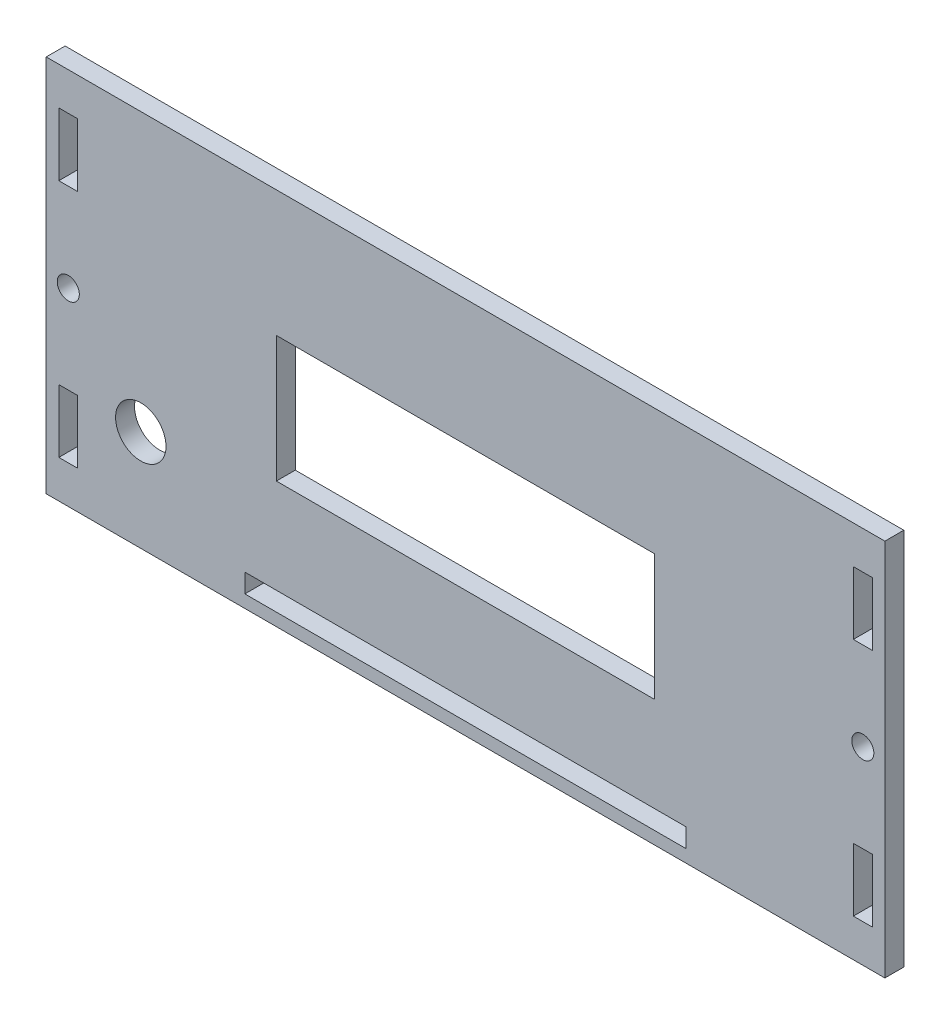
ISO-10303-21;
HEADER;
FILE_DESCRIPTION(('STEP AP214'),'2;1');
FILE_NAME('part.step','',(''),(''),'','','');
FILE_SCHEMA(('AUTOMOTIVE_DESIGN { 1 0 10303 214 1 1 1 1 }'));
ENDSEC;
DATA;
#1=APPLICATION_CONTEXT('core data for automotive mechanical design processes');
#2=APPLICATION_PROTOCOL_DEFINITION('international standard','automotive_design',2000,#1);
#3=PRODUCT_CONTEXT('',#1,'mechanical');
#4=PRODUCT('Part','Part','',(#3));
#5=PRODUCT_RELATED_PRODUCT_CATEGORY('part','',(#4));
#6=PRODUCT_DEFINITION_FORMATION('','',#4);
#7=PRODUCT_DEFINITION_CONTEXT('part definition',#1,'design');
#8=PRODUCT_DEFINITION('design','',#6,#7);
#9=PRODUCT_DEFINITION_SHAPE('','',#8);
#10=(LENGTH_UNIT() NAMED_UNIT(*) SI_UNIT(.MILLI.,.METRE.));
#11=(NAMED_UNIT(*) PLANE_ANGLE_UNIT() SI_UNIT($,.RADIAN.));
#12=(NAMED_UNIT(*) SI_UNIT($,.STERADIAN.) SOLID_ANGLE_UNIT());
#13=UNCERTAINTY_MEASURE_WITH_UNIT(LENGTH_MEASURE(1.E-05),#10,'distance_accuracy_value','');
#14=(GEOMETRIC_REPRESENTATION_CONTEXT(3) GLOBAL_UNCERTAINTY_ASSIGNED_CONTEXT((#13)) GLOBAL_UNIT_ASSIGNED_CONTEXT((#10,
#11,#12)) REPRESENTATION_CONTEXT('',''));
#15=CARTESIAN_POINT('',(0.,0.,0.));
#16=DIRECTION('',(0.,0.,1.));
#17=DIRECTION('',(1.,0.,0.));
#18=AXIS2_PLACEMENT_3D('',#15,#16,#17);
#19=CARTESIAN_POINT('',(0.,0.,3.));
#20=DIRECTION('',(0.,0.,1.));
#21=DIRECTION('',(1.,0.,0.));
#22=AXIS2_PLACEMENT_3D('',#19,#20,#21);
#23=PLANE('',#22);
#24=CARTESIAN_POINT('',(-51.5,-14.,3.));
#25=DIRECTION('',(0.,0.,1.));
#26=DIRECTION('',(1.,0.,0.));
#27=AXIS2_PLACEMENT_3D('',#24,#25,#26);
#28=CIRCLE('',#27,4.00000000000001);
#29=CARTESIAN_POINT('',(-47.5,-14.,3.));
#30=VERTEX_POINT('',#29);
#31=EDGE_CURVE('E247',#30,#30,#28,.T.);
#32=ORIENTED_EDGE('',*,*,#31,.F.);
#33=EDGE_LOOP('',(#32));
#34=FACE_BOUND('',#33,.T.);
#35=DIRECTION('',(-1.,0.,0.));
#36=VECTOR('',#35,1.);
#37=CARTESIAN_POINT('',(61.5,24.,3.));
#38=LINE('',#37,#36);
#39=CARTESIAN_POINT('',(64.5,24.,3.));
#40=VERTEX_POINT('',#39);
#41=CARTESIAN_POINT('',(61.5,24.,3.));
#42=VERTEX_POINT('',#41);
#43=EDGE_CURVE('E296',#40,#42,#38,.T.);
#44=ORIENTED_EDGE('',*,*,#43,.F.);
#45=DIRECTION('',(0.,1.,0.));
#46=VECTOR('',#45,1.);
#47=CARTESIAN_POINT('',(64.5,24.,3.));
#48=LINE('',#47,#46);
#49=CARTESIAN_POINT('',(64.5,14.,3.));
#50=VERTEX_POINT('',#49);
#51=EDGE_CURVE('E294',#50,#40,#48,.T.);
#52=ORIENTED_EDGE('',*,*,#51,.F.);
#53=DIRECTION('',(1.,0.,0.));
#54=VECTOR('',#53,1.);
#55=CARTESIAN_POINT('',(61.5,14.,3.));
#56=LINE('',#55,#54);
#57=CARTESIAN_POINT('',(61.5,14.,3.));
#58=VERTEX_POINT('',#57);
#59=EDGE_CURVE('E302',#58,#50,#56,.T.);
#60=ORIENTED_EDGE('',*,*,#59,.F.);
#61=DIRECTION('',(0.,-1.,0.));
#62=VECTOR('',#61,1.);
#63=CARTESIAN_POINT('',(61.5,24.,3.));
#64=LINE('',#63,#62);
#65=EDGE_CURVE('E299',#42,#58,#64,.T.);
#66=ORIENTED_EDGE('',*,*,#65,.F.);
#67=EDGE_LOOP('',(#44,#52,#60,#66));
#68=FACE_BOUND('',#67,.T.);
#69=DIRECTION('',(-1.,0.,0.));
#70=VECTOR('',#69,1.);
#71=CARTESIAN_POINT('',(-64.5,24.,3.));
#72=LINE('',#71,#70);
#73=CARTESIAN_POINT('',(-61.5,24.,3.));
#74=VERTEX_POINT('',#73);
#75=CARTESIAN_POINT('',(-64.5,24.,3.));
#76=VERTEX_POINT('',#75);
#77=EDGE_CURVE('E327',#74,#76,#72,.T.);
#78=ORIENTED_EDGE('',*,*,#77,.F.);
#79=DIRECTION('',(0.,1.,0.));
#80=VECTOR('',#79,1.);
#81=CARTESIAN_POINT('',(-61.5,24.,3.));
#82=LINE('',#81,#80);
#83=CARTESIAN_POINT('',(-61.5,14.,3.));
#84=VERTEX_POINT('',#83);
#85=EDGE_CURVE('E325',#84,#74,#82,.T.);
#86=ORIENTED_EDGE('',*,*,#85,.F.);
#87=DIRECTION('',(1.,0.,0.));
#88=VECTOR('',#87,1.);
#89=CARTESIAN_POINT('',(-64.5,14.,3.));
#90=LINE('',#89,#88);
#91=CARTESIAN_POINT('',(-64.5,14.,3.));
#92=VERTEX_POINT('',#91);
#93=EDGE_CURVE('E333',#92,#84,#90,.T.);
#94=ORIENTED_EDGE('',*,*,#93,.F.);
#95=DIRECTION('',(0.,-1.,0.));
#96=VECTOR('',#95,1.);
#97=CARTESIAN_POINT('',(-64.5,24.,3.));
#98=LINE('',#97,#96);
#99=EDGE_CURVE('E330',#76,#92,#98,.T.);
#100=ORIENTED_EDGE('',*,*,#99,.F.);
#101=EDGE_LOOP('',(#78,#86,#94,#100));
#102=FACE_BOUND('',#101,.T.);
#103=DIRECTION('',(-1.,0.,0.));
#104=VECTOR('',#103,1.);
#105=CARTESIAN_POINT('',(-35.,-25.,3.));
#106=LINE('',#105,#104);
#107=CARTESIAN_POINT('',(35.,-25.,3.));
#108=VERTEX_POINT('',#107);
#109=CARTESIAN_POINT('',(-35.,-25.,3.));
#110=VERTEX_POINT('',#109);
#111=EDGE_CURVE('E358',#108,#110,#106,.T.);
#112=ORIENTED_EDGE('',*,*,#111,.F.);
#113=DIRECTION('',(0.,1.,0.));
#114=VECTOR('',#113,1.);
#115=CARTESIAN_POINT('',(35.,-25.,3.));
#116=LINE('',#115,#114);
#117=CARTESIAN_POINT('',(35.,-28.,3.));
#118=VERTEX_POINT('',#117);
#119=EDGE_CURVE('E356',#118,#108,#116,.T.);
#120=ORIENTED_EDGE('',*,*,#119,.F.);
#121=DIRECTION('',(1.,0.,0.));
#122=VECTOR('',#121,1.);
#123=CARTESIAN_POINT('',(-35.,-28.,3.));
#124=LINE('',#123,#122);
#125=CARTESIAN_POINT('',(-35.,-28.,3.));
#126=VERTEX_POINT('',#125);
#127=EDGE_CURVE('E364',#126,#118,#124,.T.);
#128=ORIENTED_EDGE('',*,*,#127,.F.);
#129=DIRECTION('',(0.,-1.,0.));
#130=VECTOR('',#129,1.);
#131=CARTESIAN_POINT('',(-35.,-25.,3.));
#132=LINE('',#131,#130);
#133=EDGE_CURVE('E361',#110,#126,#132,.T.);
#134=ORIENTED_EDGE('',*,*,#133,.F.);
#135=EDGE_LOOP('',(#112,#120,#128,#134));
#136=FACE_BOUND('',#135,.T.);
#137=DIRECTION('',(-1.,0.,0.));
#138=VECTOR('',#137,1.);
#139=CARTESIAN_POINT('',(-30.,10.,3.));
#140=LINE('',#139,#138);
#141=CARTESIAN_POINT('',(30.,10.,3.));
#142=VERTEX_POINT('',#141);
#143=CARTESIAN_POINT('',(-30.,10.,3.));
#144=VERTEX_POINT('',#143);
#145=EDGE_CURVE('E389',#142,#144,#140,.T.);
#146=ORIENTED_EDGE('',*,*,#145,.F.);
#147=DIRECTION('',(0.,1.,0.));
#148=VECTOR('',#147,1.);
#149=CARTESIAN_POINT('',(30.,10.,3.));
#150=LINE('',#149,#148);
#151=CARTESIAN_POINT('',(30.,-9.99999999999999,3.));
#152=VERTEX_POINT('',#151);
#153=EDGE_CURVE('E387',#152,#142,#150,.T.);
#154=ORIENTED_EDGE('',*,*,#153,.F.);
#155=DIRECTION('',(1.,0.,0.));
#156=VECTOR('',#155,1.);
#157=CARTESIAN_POINT('',(-30.,-9.99999999999999,3.));
#158=LINE('',#157,#156);
#159=CARTESIAN_POINT('',(-30.,-9.99999999999999,3.));
#160=VERTEX_POINT('',#159);
#161=EDGE_CURVE('E395',#160,#152,#158,.T.);
#162=ORIENTED_EDGE('',*,*,#161,.F.);
#163=DIRECTION('',(0.,-1.,0.));
#164=VECTOR('',#163,1.);
#165=CARTESIAN_POINT('',(-30.,10.,3.));
#166=LINE('',#165,#164);
#167=EDGE_CURVE('E392',#144,#160,#166,.T.);
#168=ORIENTED_EDGE('',*,*,#167,.F.);
#169=EDGE_LOOP('',(#146,#154,#162,#168));
#170=FACE_BOUND('',#169,.T.);
#171=DIRECTION('',(0.,1.,0.));
#172=VECTOR('',#171,1.);
#173=CARTESIAN_POINT('',(66.5,30.,3.));
#174=LINE('',#173,#172);
#175=CARTESIAN_POINT('',(66.5,-30.,3.));
#176=VERTEX_POINT('',#175);
#177=CARTESIAN_POINT('',(66.5,30.,3.));
#178=VERTEX_POINT('',#177);
#179=EDGE_CURVE('E418',#176,#178,#174,.T.);
#180=ORIENTED_EDGE('',*,*,#179,.T.);
#181=DIRECTION('',(-1.,0.,0.));
#182=VECTOR('',#181,1.);
#183=CARTESIAN_POINT('',(-66.5,30.,3.));
#184=LINE('',#183,#182);
#185=CARTESIAN_POINT('',(-66.5,30.,3.));
#186=VERTEX_POINT('',#185);
#187=EDGE_CURVE('E421',#178,#186,#184,.T.);
#188=ORIENTED_EDGE('',*,*,#187,.T.);
#189=DIRECTION('',(0.,-1.,0.));
#190=VECTOR('',#189,1.);
#191=CARTESIAN_POINT('',(-66.5,30.,3.));
#192=LINE('',#191,#190);
#193=CARTESIAN_POINT('',(-66.5,-30.,3.));
#194=VERTEX_POINT('',#193);
#195=EDGE_CURVE('E424',#186,#194,#192,.T.);
#196=ORIENTED_EDGE('',*,*,#195,.T.);
#197=DIRECTION('',(1.,0.,0.));
#198=VECTOR('',#197,1.);
#199=CARTESIAN_POINT('',(-66.5,-30.,3.));
#200=LINE('',#199,#198);
#201=EDGE_CURVE('E426',#194,#176,#200,.T.);
#202=ORIENTED_EDGE('',*,*,#201,.T.);
#203=EDGE_LOOP('',(#180,#188,#196,#202));
#204=FACE_BOUND('',#203,.T.);
#205=CARTESIAN_POINT('',(63.,0.,3.));
#206=DIRECTION('',(0.,0.,1.));
#207=DIRECTION('',(1.,0.,0.));
#208=AXIS2_PLACEMENT_3D('',#205,#206,#207);
#209=CIRCLE('',#208,1.75);
#210=CARTESIAN_POINT('',(64.75,0.,3.));
#211=VERTEX_POINT('',#210);
#212=EDGE_CURVE('E288',#211,#211,#209,.T.);
#213=ORIENTED_EDGE('',*,*,#212,.F.);
#214=EDGE_LOOP('',(#213));
#215=FACE_BOUND('',#214,.T.);
#216=DIRECTION('',(0.,1.,0.));
#217=VECTOR('',#216,1.);
#218=CARTESIAN_POINT('',(-61.5,-14.,3.));
#219=LINE('',#218,#217);
#220=CARTESIAN_POINT('',(-61.5,-24.,3.));
#221=VERTEX_POINT('',#220);
#222=CARTESIAN_POINT('',(-61.5,-14.,3.));
#223=VERTEX_POINT('',#222);
#224=EDGE_CURVE('E259',#221,#223,#219,.T.);
#225=ORIENTED_EDGE('',*,*,#224,.F.);
#226=DIRECTION('',(1.,0.,0.));
#227=VECTOR('',#226,1.);
#228=CARTESIAN_POINT('',(-64.5,-24.,3.));
#229=LINE('',#228,#227);
#230=CARTESIAN_POINT('',(-64.5,-24.,3.));
#231=VERTEX_POINT('',#230);
#232=EDGE_CURVE('E257',#231,#221,#229,.T.);
#233=ORIENTED_EDGE('',*,*,#232,.F.);
#234=DIRECTION('',(0.,-1.,0.));
#235=VECTOR('',#234,1.);
#236=CARTESIAN_POINT('',(-64.5,-14.,3.));
#237=LINE('',#236,#235);
#238=CARTESIAN_POINT('',(-64.5,-14.,3.));
#239=VERTEX_POINT('',#238);
#240=EDGE_CURVE('E265',#239,#231,#237,.T.);
#241=ORIENTED_EDGE('',*,*,#240,.F.);
#242=DIRECTION('',(-1.,0.,0.));
#243=VECTOR('',#242,1.);
#244=CARTESIAN_POINT('',(-64.5,-14.,3.));
#245=LINE('',#244,#243);
#246=EDGE_CURVE('E262',#223,#239,#245,.T.);
#247=ORIENTED_EDGE('',*,*,#246,.F.);
#248=EDGE_LOOP('',(#225,#233,#241,#247));
#249=FACE_BOUND('',#248,.T.);
#250=DIRECTION('',(0.,1.,0.));
#251=VECTOR('',#250,1.);
#252=CARTESIAN_POINT('',(64.5,-14.,3.));
#253=LINE('',#252,#251);
#254=CARTESIAN_POINT('',(64.5,-24.,3.));
#255=VERTEX_POINT('',#254);
#256=CARTESIAN_POINT('',(64.5,-14.,3.));
#257=VERTEX_POINT('',#256);
#258=EDGE_CURVE('E226',#255,#257,#253,.T.);
#259=ORIENTED_EDGE('',*,*,#258,.F.);
#260=DIRECTION('',(1.,0.,0.));
#261=VECTOR('',#260,1.);
#262=CARTESIAN_POINT('',(61.5,-24.,3.));
#263=LINE('',#262,#261);
#264=CARTESIAN_POINT('',(61.5,-24.,3.));
#265=VERTEX_POINT('',#264);
#266=EDGE_CURVE('E218',#265,#255,#263,.T.);
#267=ORIENTED_EDGE('',*,*,#266,.F.);
#268=DIRECTION('',(0.,-1.,0.));
#269=VECTOR('',#268,1.);
#270=CARTESIAN_POINT('',(61.5,-14.,3.));
#271=LINE('',#270,#269);
#272=CARTESIAN_POINT('',(61.5,-14.,3.));
#273=VERTEX_POINT('',#272);
#274=EDGE_CURVE('E241',#273,#265,#271,.T.);
#275=ORIENTED_EDGE('',*,*,#274,.F.);
#276=DIRECTION('',(-1.,0.,0.));
#277=VECTOR('',#276,1.);
#278=CARTESIAN_POINT('',(61.5,-14.,3.));
#279=LINE('',#278,#277);
#280=EDGE_CURVE('E239',#257,#273,#279,.T.);
#281=ORIENTED_EDGE('',*,*,#280,.F.);
#282=EDGE_LOOP('',(#259,#267,#275,#281));
#283=FACE_BOUND('',#282,.T.);
#284=CARTESIAN_POINT('',(-63.,0.,3.));
#285=DIRECTION('',(0.,0.,1.));
#286=DIRECTION('',(1.,0.,0.));
#287=AXIS2_PLACEMENT_3D('',#284,#285,#286);
#288=CIRCLE('',#287,1.75);
#289=CARTESIAN_POINT('',(-61.25,0.,3.));
#290=VERTEX_POINT('',#289);
#291=EDGE_CURVE('E606',#290,#290,#288,.T.);
#292=ORIENTED_EDGE('',*,*,#291,.F.);
#293=EDGE_LOOP('',(#292));
#294=FACE_BOUND('',#293,.T.);
#295=ADVANCED_FACE('F33',(#34,#68,#102,#136,#170,#204,#215,#249,#283,#294),#23,.T.);
#296=CARTESIAN_POINT('',(0.,0.,0.));
#297=DIRECTION('',(0.,0.,1.));
#298=DIRECTION('',(1.,0.,0.));
#299=AXIS2_PLACEMENT_3D('',#296,#297,#298);
#300=PLANE('',#299);
#301=DIRECTION('',(1.,0.,0.));
#302=VECTOR('',#301,1.);
#303=CARTESIAN_POINT('',(-64.5,-24.,0.));
#304=LINE('',#303,#302);
#305=CARTESIAN_POINT('',(-64.5,-24.,0.));
#306=VERTEX_POINT('',#305);
#307=CARTESIAN_POINT('',(-61.5,-24.,0.));
#308=VERTEX_POINT('',#307);
#309=EDGE_CURVE('E234',#306,#308,#304,.T.);
#310=ORIENTED_EDGE('',*,*,#309,.T.);
#311=DIRECTION('',(0.,1.,0.));
#312=VECTOR('',#311,1.);
#313=CARTESIAN_POINT('',(-61.5,-14.,0.));
#314=LINE('',#313,#312);
#315=CARTESIAN_POINT('',(-61.5,-14.,0.));
#316=VERTEX_POINT('',#315);
#317=EDGE_CURVE('E270',#308,#316,#314,.T.);
#318=ORIENTED_EDGE('',*,*,#317,.T.);
#319=DIRECTION('',(-1.,0.,0.));
#320=VECTOR('',#319,1.);
#321=CARTESIAN_POINT('',(-64.5,-14.,0.));
#322=LINE('',#321,#320);
#323=CARTESIAN_POINT('',(-64.5,-14.,0.));
#324=VERTEX_POINT('',#323);
#325=EDGE_CURVE('E273',#316,#324,#322,.T.);
#326=ORIENTED_EDGE('',*,*,#325,.T.);
#327=DIRECTION('',(0.,-1.,0.));
#328=VECTOR('',#327,1.);
#329=CARTESIAN_POINT('',(-64.5,-14.,0.));
#330=LINE('',#329,#328);
#331=EDGE_CURVE('E260',#324,#306,#330,.T.);
#332=ORIENTED_EDGE('',*,*,#331,.T.);
#333=EDGE_LOOP('',(#310,#318,#326,#332));
#334=FACE_BOUND('',#333,.T.);
#335=DIRECTION('',(0.,1.,0.));
#336=VECTOR('',#335,1.);
#337=CARTESIAN_POINT('',(-61.5,24.,0.));
#338=LINE('',#337,#336);
#339=CARTESIAN_POINT('',(-61.5,14.,0.));
#340=VERTEX_POINT('',#339);
#341=CARTESIAN_POINT('',(-61.5,24.,0.));
#342=VERTEX_POINT('',#341);
#343=EDGE_CURVE('E324',#340,#342,#338,.T.);
#344=ORIENTED_EDGE('',*,*,#343,.T.);
#345=DIRECTION('',(-1.,0.,0.));
#346=VECTOR('',#345,1.);
#347=CARTESIAN_POINT('',(-64.5,24.,0.));
#348=LINE('',#347,#346);
#349=CARTESIAN_POINT('',(-64.5,24.,0.));
#350=VERTEX_POINT('',#349);
#351=EDGE_CURVE('E338',#342,#350,#348,.T.);
#352=ORIENTED_EDGE('',*,*,#351,.T.);
#353=DIRECTION('',(0.,-1.,0.));
#354=VECTOR('',#353,1.);
#355=CARTESIAN_POINT('',(-64.5,24.,0.));
#356=LINE('',#355,#354);
#357=CARTESIAN_POINT('',(-64.5,14.,0.));
#358=VERTEX_POINT('',#357);
#359=EDGE_CURVE('E341',#350,#358,#356,.T.);
#360=ORIENTED_EDGE('',*,*,#359,.T.);
#361=DIRECTION('',(1.,0.,0.));
#362=VECTOR('',#361,1.);
#363=CARTESIAN_POINT('',(-64.5,14.,0.));
#364=LINE('',#363,#362);
#365=EDGE_CURVE('E328',#358,#340,#364,.T.);
#366=ORIENTED_EDGE('',*,*,#365,.T.);
#367=EDGE_LOOP('',(#344,#352,#360,#366));
#368=FACE_BOUND('',#367,.T.);
#369=DIRECTION('',(0.,1.,0.));
#370=VECTOR('',#369,1.);
#371=CARTESIAN_POINT('',(30.,10.,0.));
#372=LINE('',#371,#370);
#373=CARTESIAN_POINT('',(30.,-9.99999999999999,0.));
#374=VERTEX_POINT('',#373);
#375=CARTESIAN_POINT('',(30.,10.,0.));
#376=VERTEX_POINT('',#375);
#377=EDGE_CURVE('E386',#374,#376,#372,.T.);
#378=ORIENTED_EDGE('',*,*,#377,.T.);
#379=DIRECTION('',(-1.,0.,0.));
#380=VECTOR('',#379,1.);
#381=CARTESIAN_POINT('',(-30.,10.,0.));
#382=LINE('',#381,#380);
#383=CARTESIAN_POINT('',(-30.,10.,0.));
#384=VERTEX_POINT('',#383);
#385=EDGE_CURVE('E400',#376,#384,#382,.T.);
#386=ORIENTED_EDGE('',*,*,#385,.T.);
#387=DIRECTION('',(0.,-1.,0.));
#388=VECTOR('',#387,1.);
#389=CARTESIAN_POINT('',(-30.,10.,0.));
#390=LINE('',#389,#388);
#391=CARTESIAN_POINT('',(-30.,-9.99999999999999,0.));
#392=VERTEX_POINT('',#391);
#393=EDGE_CURVE('E403',#384,#392,#390,.T.);
#394=ORIENTED_EDGE('',*,*,#393,.T.);
#395=DIRECTION('',(1.,0.,0.));
#396=VECTOR('',#395,1.);
#397=CARTESIAN_POINT('',(-30.,-9.99999999999999,0.));
#398=LINE('',#397,#396);
#399=EDGE_CURVE('E390',#392,#374,#398,.T.);
#400=ORIENTED_EDGE('',*,*,#399,.T.);
#401=EDGE_LOOP('',(#378,#386,#394,#400));
#402=FACE_BOUND('',#401,.T.);
#403=DIRECTION('',(0.,1.,0.));
#404=VECTOR('',#403,1.);
#405=CARTESIAN_POINT('',(66.5,30.,0.));
#406=LINE('',#405,#404);
#407=CARTESIAN_POINT('',(66.5,-30.,0.));
#408=VERTEX_POINT('',#407);
#409=CARTESIAN_POINT('',(66.5,30.,0.));
#410=VERTEX_POINT('',#409);
#411=EDGE_CURVE('E417',#408,#410,#406,.T.);
#412=ORIENTED_EDGE('',*,*,#411,.F.);
#413=DIRECTION('',(1.,0.,0.));
#414=VECTOR('',#413,1.);
#415=CARTESIAN_POINT('',(-66.5,-30.,0.));
#416=LINE('',#415,#414);
#417=CARTESIAN_POINT('',(-66.5,-30.,0.));
#418=VERTEX_POINT('',#417);
#419=EDGE_CURVE('E422',#418,#408,#416,.T.);
#420=ORIENTED_EDGE('',*,*,#419,.F.);
#421=DIRECTION('',(0.,-1.,0.));
#422=VECTOR('',#421,1.);
#423=CARTESIAN_POINT('',(-66.5,30.,0.));
#424=LINE('',#423,#422);
#425=CARTESIAN_POINT('',(-66.5,30.,0.));
#426=VERTEX_POINT('',#425);
#427=EDGE_CURVE('E433',#426,#418,#424,.T.);
#428=ORIENTED_EDGE('',*,*,#427,.F.);
#429=DIRECTION('',(-1.,0.,0.));
#430=VECTOR('',#429,1.);
#431=CARTESIAN_POINT('',(-66.5,30.,0.));
#432=LINE('',#431,#430);
#433=EDGE_CURVE('E431',#410,#426,#432,.T.);
#434=ORIENTED_EDGE('',*,*,#433,.F.);
#435=EDGE_LOOP('',(#412,#420,#428,#434));
#436=FACE_BOUND('',#435,.T.);
#437=DIRECTION('',(0.,1.,0.));
#438=VECTOR('',#437,1.);
#439=CARTESIAN_POINT('',(35.,-25.,0.));
#440=LINE('',#439,#438);
#441=CARTESIAN_POINT('',(35.,-28.,0.));
#442=VERTEX_POINT('',#441);
#443=CARTESIAN_POINT('',(35.,-25.,0.));
#444=VERTEX_POINT('',#443);
#445=EDGE_CURVE('E355',#442,#444,#440,.T.);
#446=ORIENTED_EDGE('',*,*,#445,.T.);
#447=DIRECTION('',(-1.,0.,0.));
#448=VECTOR('',#447,1.);
#449=CARTESIAN_POINT('',(-35.,-25.,0.));
#450=LINE('',#449,#448);
#451=CARTESIAN_POINT('',(-35.,-25.,0.));
#452=VERTEX_POINT('',#451);
#453=EDGE_CURVE('E369',#444,#452,#450,.T.);
#454=ORIENTED_EDGE('',*,*,#453,.T.);
#455=DIRECTION('',(0.,-1.,0.));
#456=VECTOR('',#455,1.);
#457=CARTESIAN_POINT('',(-35.,-25.,0.));
#458=LINE('',#457,#456);
#459=CARTESIAN_POINT('',(-35.,-28.,0.));
#460=VERTEX_POINT('',#459);
#461=EDGE_CURVE('E372',#452,#460,#458,.T.);
#462=ORIENTED_EDGE('',*,*,#461,.T.);
#463=DIRECTION('',(1.,0.,0.));
#464=VECTOR('',#463,1.);
#465=CARTESIAN_POINT('',(-35.,-28.,0.));
#466=LINE('',#465,#464);
#467=EDGE_CURVE('E359',#460,#442,#466,.T.);
#468=ORIENTED_EDGE('',*,*,#467,.T.);
#469=EDGE_LOOP('',(#446,#454,#462,#468));
#470=FACE_BOUND('',#469,.T.);
#471=DIRECTION('',(0.,1.,0.));
#472=VECTOR('',#471,1.);
#473=CARTESIAN_POINT('',(64.5,24.,0.));
#474=LINE('',#473,#472);
#475=CARTESIAN_POINT('',(64.5,14.,0.));
#476=VERTEX_POINT('',#475);
#477=CARTESIAN_POINT('',(64.5,24.,0.));
#478=VERTEX_POINT('',#477);
#479=EDGE_CURVE('E291',#476,#478,#474,.T.);
#480=ORIENTED_EDGE('',*,*,#479,.T.);
#481=DIRECTION('',(-1.,0.,0.));
#482=VECTOR('',#481,1.);
#483=CARTESIAN_POINT('',(61.5,24.,0.));
#484=LINE('',#483,#482);
#485=CARTESIAN_POINT('',(61.5,24.,0.));
#486=VERTEX_POINT('',#485);
#487=EDGE_CURVE('E307',#478,#486,#484,.T.);
#488=ORIENTED_EDGE('',*,*,#487,.T.);
#489=DIRECTION('',(0.,-1.,0.));
#490=VECTOR('',#489,1.);
#491=CARTESIAN_POINT('',(61.5,24.,0.));
#492=LINE('',#491,#490);
#493=CARTESIAN_POINT('',(61.5,14.,0.));
#494=VERTEX_POINT('',#493);
#495=EDGE_CURVE('E310',#486,#494,#492,.T.);
#496=ORIENTED_EDGE('',*,*,#495,.T.);
#497=DIRECTION('',(1.,0.,0.));
#498=VECTOR('',#497,1.);
#499=CARTESIAN_POINT('',(61.5,14.,0.));
#500=LINE('',#499,#498);
#501=EDGE_CURVE('E297',#494,#476,#500,.T.);
#502=ORIENTED_EDGE('',*,*,#501,.T.);
#503=EDGE_LOOP('',(#480,#488,#496,#502));
#504=FACE_BOUND('',#503,.T.);
#505=CARTESIAN_POINT('',(63.,0.,0.));
#506=DIRECTION('',(0.,0.,1.));
#507=DIRECTION('',(1.,0.,0.));
#508=AXIS2_PLACEMENT_3D('',#505,#506,#507);
#509=CIRCLE('',#508,1.75);
#510=CARTESIAN_POINT('',(64.75,0.,0.));
#511=VERTEX_POINT('',#510);
#512=EDGE_CURVE('E287',#511,#511,#509,.T.);
#513=ORIENTED_EDGE('',*,*,#512,.T.);
#514=EDGE_LOOP('',(#513));
#515=FACE_BOUND('',#514,.T.);
#516=DIRECTION('',(1.,0.,0.));
#517=VECTOR('',#516,1.);
#518=CARTESIAN_POINT('',(61.5,-24.,0.));
#519=LINE('',#518,#517);
#520=CARTESIAN_POINT('',(61.5,-24.,0.));
#521=VERTEX_POINT('',#520);
#522=CARTESIAN_POINT('',(64.5,-24.,0.));
#523=VERTEX_POINT('',#522);
#524=EDGE_CURVE('E56',#521,#523,#519,.T.);
#525=ORIENTED_EDGE('',*,*,#524,.T.);
#526=DIRECTION('',(0.,1.,0.));
#527=VECTOR('',#526,1.);
#528=CARTESIAN_POINT('',(64.5,-14.,0.));
#529=LINE('',#528,#527);
#530=CARTESIAN_POINT('',(64.5,-14.,0.));
#531=VERTEX_POINT('',#530);
#532=EDGE_CURVE('E233',#523,#531,#529,.T.);
#533=ORIENTED_EDGE('',*,*,#532,.T.);
#534=DIRECTION('',(-1.,0.,0.));
#535=VECTOR('',#534,1.);
#536=CARTESIAN_POINT('',(61.5,-14.,0.));
#537=LINE('',#536,#535);
#538=CARTESIAN_POINT('',(61.5,-14.,0.));
#539=VERTEX_POINT('',#538);
#540=EDGE_CURVE('E249',#531,#539,#537,.T.);
#541=ORIENTED_EDGE('',*,*,#540,.T.);
#542=DIRECTION('',(0.,-1.,0.));
#543=VECTOR('',#542,1.);
#544=CARTESIAN_POINT('',(61.5,-14.,0.));
#545=LINE('',#544,#543);
#546=EDGE_CURVE('E227',#539,#521,#545,.T.);
#547=ORIENTED_EDGE('',*,*,#546,.T.);
#548=EDGE_LOOP('',(#525,#533,#541,#547));
#549=FACE_BOUND('',#548,.T.);
#550=CARTESIAN_POINT('',(-51.5,-14.,0.));
#551=DIRECTION('',(0.,0.,1.));
#552=DIRECTION('',(1.,0.,0.));
#553=AXIS2_PLACEMENT_3D('',#550,#551,#552);
#554=CIRCLE('',#553,4.00000000000001);
#555=CARTESIAN_POINT('',(-47.5,-14.,0.));
#556=VERTEX_POINT('',#555);
#557=EDGE_CURVE('E612',#556,#556,#554,.T.);
#558=ORIENTED_EDGE('',*,*,#557,.T.);
#559=EDGE_LOOP('',(#558));
#560=FACE_BOUND('',#559,.T.);
#561=CARTESIAN_POINT('',(-63.,0.,0.));
#562=DIRECTION('',(0.,0.,1.));
#563=DIRECTION('',(1.,0.,0.));
#564=AXIS2_PLACEMENT_3D('',#561,#562,#563);
#565=CIRCLE('',#564,1.75);
#566=CARTESIAN_POINT('',(-61.25,0.,0.));
#567=VERTEX_POINT('',#566);
#568=EDGE_CURVE('E609',#567,#567,#565,.T.);
#569=ORIENTED_EDGE('',*,*,#568,.T.);
#570=EDGE_LOOP('',(#569));
#571=FACE_BOUND('',#570,.T.);
#572=ADVANCED_FACE('F451',(#334,#368,#402,#436,#470,#504,#515,#549,#560,#571),#300,.F.);
#573=CARTESIAN_POINT('',(66.5,30.,3.));
#574=DIRECTION('',(-1.,0.,0.));
#575=DIRECTION('',(0.,-1.,0.));
#576=AXIS2_PLACEMENT_3D('',#573,#574,#575);
#577=PLANE('',#576);
#578=ORIENTED_EDGE('',*,*,#411,.T.);
#579=DIRECTION('',(0.,0.,-1.));
#580=VECTOR('',#579,1.);
#581=CARTESIAN_POINT('',(66.5,30.,3.));
#582=LINE('',#581,#580);
#583=EDGE_CURVE('E11',#178,#410,#582,.T.);
#584=ORIENTED_EDGE('',*,*,#583,.F.);
#585=ORIENTED_EDGE('',*,*,#179,.F.);
#586=DIRECTION('',(0.,0.,-1.));
#587=VECTOR('',#586,1.);
#588=CARTESIAN_POINT('',(66.5,-30.,3.));
#589=LINE('',#588,#587);
#590=EDGE_CURVE('E428',#176,#408,#589,.T.);
#591=ORIENTED_EDGE('',*,*,#590,.T.);
#592=EDGE_LOOP('',(#578,#584,#585,#591));
#593=FACE_BOUND('',#592,.T.);
#594=ADVANCED_FACE('F35',(#593),#577,.F.);
#595=CARTESIAN_POINT('',(-66.5,30.,3.));
#596=DIRECTION('',(0.,-1.,0.));
#597=DIRECTION('',(0.,0.,-1.));
#598=AXIS2_PLACEMENT_3D('',#595,#596,#597);
#599=PLANE('',#598);
#600=ORIENTED_EDGE('',*,*,#433,.T.);
#601=DIRECTION('',(0.,0.,-1.));
#602=VECTOR('',#601,1.);
#603=CARTESIAN_POINT('',(-66.5,30.,3.));
#604=LINE('',#603,#602);
#605=EDGE_CURVE('E41',#186,#426,#604,.T.);
#606=ORIENTED_EDGE('',*,*,#605,.F.);
#607=ORIENTED_EDGE('',*,*,#187,.F.);
#608=ORIENTED_EDGE('',*,*,#583,.T.);
#609=EDGE_LOOP('',(#600,#606,#607,#608));
#610=FACE_BOUND('',#609,.T.);
#611=ADVANCED_FACE('F462',(#610),#599,.F.);
#612=CARTESIAN_POINT('',(-66.5,30.,3.));
#613=DIRECTION('',(1.,0.,0.));
#614=DIRECTION('',(0.,1.,0.));
#615=AXIS2_PLACEMENT_3D('',#612,#613,#614);
#616=PLANE('',#615);
#617=ORIENTED_EDGE('',*,*,#427,.T.);
#618=DIRECTION('',(0.,0.,-1.));
#619=VECTOR('',#618,1.);
#620=CARTESIAN_POINT('',(-66.5,-30.,3.));
#621=LINE('',#620,#619);
#622=EDGE_CURVE('E438',#194,#418,#621,.T.);
#623=ORIENTED_EDGE('',*,*,#622,.F.);
#624=ORIENTED_EDGE('',*,*,#195,.F.);
#625=ORIENTED_EDGE('',*,*,#605,.T.);
#626=EDGE_LOOP('',(#617,#623,#624,#625));
#627=FACE_BOUND('',#626,.T.);
#628=ADVANCED_FACE('F445',(#627),#616,.F.);
#629=CARTESIAN_POINT('',(-66.5,-30.,3.));
#630=DIRECTION('',(0.,1.,0.));
#631=DIRECTION('',(0.,0.,1.));
#632=AXIS2_PLACEMENT_3D('',#629,#630,#631);
#633=PLANE('',#632);
#634=ORIENTED_EDGE('',*,*,#419,.T.);
#635=ORIENTED_EDGE('',*,*,#590,.F.);
#636=ORIENTED_EDGE('',*,*,#201,.F.);
#637=ORIENTED_EDGE('',*,*,#622,.T.);
#638=EDGE_LOOP('',(#634,#635,#636,#637));
#639=FACE_BOUND('',#638,.T.);
#640=ADVANCED_FACE('F455',(#639),#633,.F.);
#641=CARTESIAN_POINT('',(30.,10.,3.));
#642=DIRECTION('',(-1.,0.,0.));
#643=DIRECTION('',(0.,0.,1.));
#644=AXIS2_PLACEMENT_3D('',#641,#642,#643);
#645=PLANE('',#644);
#646=ORIENTED_EDGE('',*,*,#377,.F.);
#647=DIRECTION('',(0.,0.,-1.));
#648=VECTOR('',#647,1.);
#649=CARTESIAN_POINT('',(30.,-9.99999999999999,3.));
#650=LINE('',#649,#648);
#651=EDGE_CURVE('E397',#152,#374,#650,.T.);
#652=ORIENTED_EDGE('',*,*,#651,.F.);
#653=ORIENTED_EDGE('',*,*,#153,.T.);
#654=DIRECTION('',(0.,0.,-1.));
#655=VECTOR('',#654,1.);
#656=CARTESIAN_POINT('',(30.,10.,3.));
#657=LINE('',#656,#655);
#658=EDGE_CURVE('E414',#142,#376,#657,.T.);
#659=ORIENTED_EDGE('',*,*,#658,.T.);
#660=EDGE_LOOP('',(#646,#652,#653,#659));
#661=FACE_BOUND('',#660,.T.);
#662=ADVANCED_FACE('F480',(#661),#645,.T.);
#663=CARTESIAN_POINT('',(-30.,10.,3.));
#664=DIRECTION('',(0.,-1.,0.));
#665=DIRECTION('',(0.,0.,-1.));
#666=AXIS2_PLACEMENT_3D('',#663,#664,#665);
#667=PLANE('',#666);
#668=ORIENTED_EDGE('',*,*,#385,.F.);
#669=ORIENTED_EDGE('',*,*,#658,.F.);
#670=ORIENTED_EDGE('',*,*,#145,.T.);
#671=DIRECTION('',(0.,0.,-1.));
#672=VECTOR('',#671,1.);
#673=CARTESIAN_POINT('',(-30.,10.,3.));
#674=LINE('',#673,#672);
#675=EDGE_CURVE('E412',#144,#384,#674,.T.);
#676=ORIENTED_EDGE('',*,*,#675,.T.);
#677=EDGE_LOOP('',(#668,#669,#670,#676));
#678=FACE_BOUND('',#677,.T.);
#679=ADVANCED_FACE('F487',(#678),#667,.T.);
#680=CARTESIAN_POINT('',(-30.,10.,3.));
#681=DIRECTION('',(1.,0.,0.));
#682=DIRECTION('',(0.,1.,0.));
#683=AXIS2_PLACEMENT_3D('',#680,#681,#682);
#684=PLANE('',#683);
#685=ORIENTED_EDGE('',*,*,#393,.F.);
#686=ORIENTED_EDGE('',*,*,#675,.F.);
#687=ORIENTED_EDGE('',*,*,#167,.T.);
#688=DIRECTION('',(0.,0.,-1.));
#689=VECTOR('',#688,1.);
#690=CARTESIAN_POINT('',(-30.,-9.99999999999999,3.));
#691=LINE('',#690,#689);
#692=EDGE_CURVE('E410',#160,#392,#691,.T.);
#693=ORIENTED_EDGE('',*,*,#692,.T.);
#694=EDGE_LOOP('',(#685,#686,#687,#693));
#695=FACE_BOUND('',#694,.T.);
#696=ADVANCED_FACE('F492',(#695),#684,.T.);
#697=CARTESIAN_POINT('',(-30.,-9.99999999999999,3.));
#698=DIRECTION('',(0.,1.,0.));
#699=DIRECTION('',(0.,0.,1.));
#700=AXIS2_PLACEMENT_3D('',#697,#698,#699);
#701=PLANE('',#700);
#702=ORIENTED_EDGE('',*,*,#399,.F.);
#703=ORIENTED_EDGE('',*,*,#692,.F.);
#704=ORIENTED_EDGE('',*,*,#161,.T.);
#705=ORIENTED_EDGE('',*,*,#651,.T.);
#706=EDGE_LOOP('',(#702,#703,#704,#705));
#707=FACE_BOUND('',#706,.T.);
#708=ADVANCED_FACE('F500',(#707),#701,.T.);
#709=CARTESIAN_POINT('',(35.,-25.,3.));
#710=DIRECTION('',(-1.,0.,0.));
#711=DIRECTION('',(0.,0.,1.));
#712=AXIS2_PLACEMENT_3D('',#709,#710,#711);
#713=PLANE('',#712);
#714=ORIENTED_EDGE('',*,*,#445,.F.);
#715=DIRECTION('',(0.,0.,-1.));
#716=VECTOR('',#715,1.);
#717=CARTESIAN_POINT('',(35.,-28.,3.));
#718=LINE('',#717,#716);
#719=EDGE_CURVE('E366',#118,#442,#718,.T.);
#720=ORIENTED_EDGE('',*,*,#719,.F.);
#721=ORIENTED_EDGE('',*,*,#119,.T.);
#722=DIRECTION('',(0.,0.,-1.));
#723=VECTOR('',#722,1.);
#724=CARTESIAN_POINT('',(35.,-25.,3.));
#725=LINE('',#724,#723);
#726=EDGE_CURVE('E383',#108,#444,#725,.T.);
#727=ORIENTED_EDGE('',*,*,#726,.T.);
#728=EDGE_LOOP('',(#714,#720,#721,#727));
#729=FACE_BOUND('',#728,.T.);
#730=ADVANCED_FACE('F513',(#729),#713,.T.);
#731=CARTESIAN_POINT('',(-35.,-25.,3.));
#732=DIRECTION('',(0.,-1.,0.));
#733=DIRECTION('',(0.,0.,-1.));
#734=AXIS2_PLACEMENT_3D('',#731,#732,#733);
#735=PLANE('',#734);
#736=ORIENTED_EDGE('',*,*,#453,.F.);
#737=ORIENTED_EDGE('',*,*,#726,.F.);
#738=ORIENTED_EDGE('',*,*,#111,.T.);
#739=DIRECTION('',(0.,0.,-1.));
#740=VECTOR('',#739,1.);
#741=CARTESIAN_POINT('',(-35.,-25.,3.));
#742=LINE('',#741,#740);
#743=EDGE_CURVE('E381',#110,#452,#742,.T.);
#744=ORIENTED_EDGE('',*,*,#743,.T.);
#745=EDGE_LOOP('',(#736,#737,#738,#744));
#746=FACE_BOUND('',#745,.T.);
#747=ADVANCED_FACE('F518',(#746),#735,.T.);
#748=CARTESIAN_POINT('',(-35.,-25.,3.));
#749=DIRECTION('',(1.,0.,0.));
#750=DIRECTION('',(0.,0.,-1.));
#751=AXIS2_PLACEMENT_3D('',#748,#749,#750);
#752=PLANE('',#751);
#753=ORIENTED_EDGE('',*,*,#461,.F.);
#754=ORIENTED_EDGE('',*,*,#743,.F.);
#755=ORIENTED_EDGE('',*,*,#133,.T.);
#756=DIRECTION('',(0.,0.,-1.));
#757=VECTOR('',#756,1.);
#758=CARTESIAN_POINT('',(-35.,-28.,3.));
#759=LINE('',#758,#757);
#760=EDGE_CURVE('E379',#126,#460,#759,.T.);
#761=ORIENTED_EDGE('',*,*,#760,.T.);
#762=EDGE_LOOP('',(#753,#754,#755,#761));
#763=FACE_BOUND('',#762,.T.);
#764=ADVANCED_FACE('F522',(#763),#752,.T.);
#765=CARTESIAN_POINT('',(-35.,-28.,3.));
#766=DIRECTION('',(0.,1.,0.));
#767=DIRECTION('',(0.,0.,1.));
#768=AXIS2_PLACEMENT_3D('',#765,#766,#767);
#769=PLANE('',#768);
#770=ORIENTED_EDGE('',*,*,#467,.F.);
#771=ORIENTED_EDGE('',*,*,#760,.F.);
#772=ORIENTED_EDGE('',*,*,#127,.T.);
#773=ORIENTED_EDGE('',*,*,#719,.T.);
#774=EDGE_LOOP('',(#770,#771,#772,#773));
#775=FACE_BOUND('',#774,.T.);
#776=ADVANCED_FACE('F526',(#775),#769,.T.);
#777=CARTESIAN_POINT('',(-61.5,24.,3.));
#778=DIRECTION('',(-1.,0.,0.));
#779=DIRECTION('',(0.,0.,1.));
#780=AXIS2_PLACEMENT_3D('',#777,#778,#779);
#781=PLANE('',#780);
#782=ORIENTED_EDGE('',*,*,#343,.F.);
#783=DIRECTION('',(0.,0.,-1.));
#784=VECTOR('',#783,1.);
#785=CARTESIAN_POINT('',(-61.5,14.,3.));
#786=LINE('',#785,#784);
#787=EDGE_CURVE('E335',#84,#340,#786,.T.);
#788=ORIENTED_EDGE('',*,*,#787,.F.);
#789=ORIENTED_EDGE('',*,*,#85,.T.);
#790=DIRECTION('',(0.,0.,-1.));
#791=VECTOR('',#790,1.);
#792=CARTESIAN_POINT('',(-61.5,24.,3.));
#793=LINE('',#792,#791);
#794=EDGE_CURVE('E352',#74,#342,#793,.T.);
#795=ORIENTED_EDGE('',*,*,#794,.T.);
#796=EDGE_LOOP('',(#782,#788,#789,#795));
#797=FACE_BOUND('',#796,.T.);
#798=ADVANCED_FACE('F530',(#797),#781,.T.);
#799=CARTESIAN_POINT('',(-64.5,24.,3.));
#800=DIRECTION('',(0.,-1.,0.));
#801=DIRECTION('',(0.,0.,-1.));
#802=AXIS2_PLACEMENT_3D('',#799,#800,#801);
#803=PLANE('',#802);
#804=ORIENTED_EDGE('',*,*,#351,.F.);
#805=ORIENTED_EDGE('',*,*,#794,.F.);
#806=ORIENTED_EDGE('',*,*,#77,.T.);
#807=DIRECTION('',(0.,0.,-1.));
#808=VECTOR('',#807,1.);
#809=CARTESIAN_POINT('',(-64.5,24.,3.));
#810=LINE('',#809,#808);
#811=EDGE_CURVE('E350',#76,#350,#810,.T.);
#812=ORIENTED_EDGE('',*,*,#811,.T.);
#813=EDGE_LOOP('',(#804,#805,#806,#812));
#814=FACE_BOUND('',#813,.T.);
#815=ADVANCED_FACE('F534',(#814),#803,.T.);
#816=CARTESIAN_POINT('',(-64.5,24.,3.));
#817=DIRECTION('',(1.,0.,0.));
#818=DIRECTION('',(0.,0.,-1.));
#819=AXIS2_PLACEMENT_3D('',#816,#817,#818);
#820=PLANE('',#819);
#821=ORIENTED_EDGE('',*,*,#359,.F.);
#822=ORIENTED_EDGE('',*,*,#811,.F.);
#823=ORIENTED_EDGE('',*,*,#99,.T.);
#824=DIRECTION('',(0.,0.,-1.));
#825=VECTOR('',#824,1.);
#826=CARTESIAN_POINT('',(-64.5,14.,3.));
#827=LINE('',#826,#825);
#828=EDGE_CURVE('E348',#92,#358,#827,.T.);
#829=ORIENTED_EDGE('',*,*,#828,.T.);
#830=EDGE_LOOP('',(#821,#822,#823,#829));
#831=FACE_BOUND('',#830,.T.);
#832=ADVANCED_FACE('F538',(#831),#820,.T.);
#833=CARTESIAN_POINT('',(-64.5,14.,3.));
#834=DIRECTION('',(0.,1.,0.));
#835=DIRECTION('',(0.,0.,1.));
#836=AXIS2_PLACEMENT_3D('',#833,#834,#835);
#837=PLANE('',#836);
#838=ORIENTED_EDGE('',*,*,#365,.F.);
#839=ORIENTED_EDGE('',*,*,#828,.F.);
#840=ORIENTED_EDGE('',*,*,#93,.T.);
#841=ORIENTED_EDGE('',*,*,#787,.T.);
#842=EDGE_LOOP('',(#838,#839,#840,#841));
#843=FACE_BOUND('',#842,.T.);
#844=ADVANCED_FACE('F542',(#843),#837,.T.);
#845=CARTESIAN_POINT('',(64.5,24.,3.));
#846=DIRECTION('',(-1.,0.,0.));
#847=DIRECTION('',(0.,0.,1.));
#848=AXIS2_PLACEMENT_3D('',#845,#846,#847);
#849=PLANE('',#848);
#850=ORIENTED_EDGE('',*,*,#479,.F.);
#851=DIRECTION('',(0.,0.,-1.));
#852=VECTOR('',#851,1.);
#853=CARTESIAN_POINT('',(64.5,14.,3.));
#854=LINE('',#853,#852);
#855=EDGE_CURVE('E304',#50,#476,#854,.T.);
#856=ORIENTED_EDGE('',*,*,#855,.F.);
#857=ORIENTED_EDGE('',*,*,#51,.T.);
#858=DIRECTION('',(0.,0.,-1.));
#859=VECTOR('',#858,1.);
#860=CARTESIAN_POINT('',(64.5,24.,3.));
#861=LINE('',#860,#859);
#862=EDGE_CURVE('E321',#40,#478,#861,.T.);
#863=ORIENTED_EDGE('',*,*,#862,.T.);
#864=EDGE_LOOP('',(#850,#856,#857,#863));
#865=FACE_BOUND('',#864,.T.);
#866=ADVANCED_FACE('F546',(#865),#849,.T.);
#867=CARTESIAN_POINT('',(61.5,24.,3.));
#868=DIRECTION('',(0.,-1.,0.));
#869=DIRECTION('',(0.,0.,-1.));
#870=AXIS2_PLACEMENT_3D('',#867,#868,#869);
#871=PLANE('',#870);
#872=ORIENTED_EDGE('',*,*,#487,.F.);
#873=ORIENTED_EDGE('',*,*,#862,.F.);
#874=ORIENTED_EDGE('',*,*,#43,.T.);
#875=DIRECTION('',(0.,0.,-1.));
#876=VECTOR('',#875,1.);
#877=CARTESIAN_POINT('',(61.5,24.,3.));
#878=LINE('',#877,#876);
#879=EDGE_CURVE('E319',#42,#486,#878,.T.);
#880=ORIENTED_EDGE('',*,*,#879,.T.);
#881=EDGE_LOOP('',(#872,#873,#874,#880));
#882=FACE_BOUND('',#881,.T.);
#883=ADVANCED_FACE('F550',(#882),#871,.T.);
#884=CARTESIAN_POINT('',(61.5,24.,3.));
#885=DIRECTION('',(1.,0.,0.));
#886=DIRECTION('',(0.,0.,-1.));
#887=AXIS2_PLACEMENT_3D('',#884,#885,#886);
#888=PLANE('',#887);
#889=ORIENTED_EDGE('',*,*,#495,.F.);
#890=ORIENTED_EDGE('',*,*,#879,.F.);
#891=ORIENTED_EDGE('',*,*,#65,.T.);
#892=DIRECTION('',(0.,0.,-1.));
#893=VECTOR('',#892,1.);
#894=CARTESIAN_POINT('',(61.5,14.,3.));
#895=LINE('',#894,#893);
#896=EDGE_CURVE('E317',#58,#494,#895,.T.);
#897=ORIENTED_EDGE('',*,*,#896,.T.);
#898=EDGE_LOOP('',(#889,#890,#891,#897));
#899=FACE_BOUND('',#898,.T.);
#900=ADVANCED_FACE('F554',(#899),#888,.T.);
#901=CARTESIAN_POINT('',(61.5,14.,3.));
#902=DIRECTION('',(0.,1.,0.));
#903=DIRECTION('',(0.,0.,1.));
#904=AXIS2_PLACEMENT_3D('',#901,#902,#903);
#905=PLANE('',#904);
#906=ORIENTED_EDGE('',*,*,#501,.F.);
#907=ORIENTED_EDGE('',*,*,#896,.F.);
#908=ORIENTED_EDGE('',*,*,#59,.T.);
#909=ORIENTED_EDGE('',*,*,#855,.T.);
#910=EDGE_LOOP('',(#906,#907,#908,#909));
#911=FACE_BOUND('',#910,.T.);
#912=ADVANCED_FACE('F558',(#911),#905,.T.);
#913=CARTESIAN_POINT('',(63.,0.,3.));
#914=DIRECTION('',(0.,0.,-1.));
#915=DIRECTION('',(-1.,0.,0.));
#916=AXIS2_PLACEMENT_3D('',#913,#914,#915);
#917=CYLINDRICAL_SURFACE('',#916,1.75);
#918=ORIENTED_EDGE('',*,*,#212,.T.);
#919=EDGE_LOOP('',(#918));
#920=FACE_BOUND('',#919,.T.);
#921=ORIENTED_EDGE('',*,*,#512,.F.);
#922=EDGE_LOOP('',(#921));
#923=FACE_BOUND('',#922,.T.);
#924=ADVANCED_FACE('F562',(#920,#923),#917,.F.);
#925=CARTESIAN_POINT('',(-64.5,-24.,3.));
#926=DIRECTION('',(0.,1.,0.));
#927=DIRECTION('',(0.,0.,1.));
#928=AXIS2_PLACEMENT_3D('',#925,#926,#927);
#929=PLANE('',#928);
#930=ORIENTED_EDGE('',*,*,#309,.F.);
#931=DIRECTION('',(0.,0.,-1.));
#932=VECTOR('',#931,1.);
#933=CARTESIAN_POINT('',(-64.5,-24.,3.));
#934=LINE('',#933,#932);
#935=EDGE_CURVE('E267',#231,#306,#934,.T.);
#936=ORIENTED_EDGE('',*,*,#935,.F.);
#937=ORIENTED_EDGE('',*,*,#232,.T.);
#938=DIRECTION('',(0.,0.,-1.));
#939=VECTOR('',#938,1.);
#940=CARTESIAN_POINT('',(-61.5,-24.,3.));
#941=LINE('',#940,#939);
#942=EDGE_CURVE('E284',#221,#308,#941,.T.);
#943=ORIENTED_EDGE('',*,*,#942,.T.);
#944=EDGE_LOOP('',(#930,#936,#937,#943));
#945=FACE_BOUND('',#944,.T.);
#946=ADVANCED_FACE('F566',(#945),#929,.T.);
#947=CARTESIAN_POINT('',(-61.5,-14.,3.));
#948=DIRECTION('',(-1.,0.,0.));
#949=DIRECTION('',(0.,0.,1.));
#950=AXIS2_PLACEMENT_3D('',#947,#948,#949);
#951=PLANE('',#950);
#952=ORIENTED_EDGE('',*,*,#317,.F.);
#953=ORIENTED_EDGE('',*,*,#942,.F.);
#954=ORIENTED_EDGE('',*,*,#224,.T.);
#955=DIRECTION('',(0.,0.,-1.));
#956=VECTOR('',#955,1.);
#957=CARTESIAN_POINT('',(-61.5,-14.,3.));
#958=LINE('',#957,#956);
#959=EDGE_CURVE('E282',#223,#316,#958,.T.);
#960=ORIENTED_EDGE('',*,*,#959,.T.);
#961=EDGE_LOOP('',(#952,#953,#954,#960));
#962=FACE_BOUND('',#961,.T.);
#963=ADVANCED_FACE('F570',(#962),#951,.T.);
#964=CARTESIAN_POINT('',(-64.5,-14.,3.));
#965=DIRECTION('',(0.,-1.,0.));
#966=DIRECTION('',(0.,0.,-1.));
#967=AXIS2_PLACEMENT_3D('',#964,#965,#966);
#968=PLANE('',#967);
#969=ORIENTED_EDGE('',*,*,#325,.F.);
#970=ORIENTED_EDGE('',*,*,#959,.F.);
#971=ORIENTED_EDGE('',*,*,#246,.T.);
#972=DIRECTION('',(0.,0.,-1.));
#973=VECTOR('',#972,1.);
#974=CARTESIAN_POINT('',(-64.5,-14.,3.));
#975=LINE('',#974,#973);
#976=EDGE_CURVE('E280',#239,#324,#975,.T.);
#977=ORIENTED_EDGE('',*,*,#976,.T.);
#978=EDGE_LOOP('',(#969,#970,#971,#977));
#979=FACE_BOUND('',#978,.T.);
#980=ADVANCED_FACE('F574',(#979),#968,.T.);
#981=CARTESIAN_POINT('',(-64.5,-14.,3.));
#982=DIRECTION('',(1.,0.,0.));
#983=DIRECTION('',(0.,0.,-1.));
#984=AXIS2_PLACEMENT_3D('',#981,#982,#983);
#985=PLANE('',#984);
#986=ORIENTED_EDGE('',*,*,#331,.F.);
#987=ORIENTED_EDGE('',*,*,#976,.F.);
#988=ORIENTED_EDGE('',*,*,#240,.T.);
#989=ORIENTED_EDGE('',*,*,#935,.T.);
#990=EDGE_LOOP('',(#986,#987,#988,#989));
#991=FACE_BOUND('',#990,.T.);
#992=ADVANCED_FACE('F578',(#991),#985,.T.);
#993=CARTESIAN_POINT('',(61.5,-24.,3.));
#994=DIRECTION('',(0.,1.,0.));
#995=DIRECTION('',(0.,0.,1.));
#996=AXIS2_PLACEMENT_3D('',#993,#994,#995);
#997=PLANE('',#996);
#998=ORIENTED_EDGE('',*,*,#524,.F.);
#999=DIRECTION('',(0.,0.,-1.));
#1000=VECTOR('',#999,1.);
#1001=CARTESIAN_POINT('',(61.5,-24.,3.));
#1002=LINE('',#1001,#1000);
#1003=EDGE_CURVE('E222',#265,#521,#1002,.T.);
#1004=ORIENTED_EDGE('',*,*,#1003,.F.);
#1005=ORIENTED_EDGE('',*,*,#266,.T.);
#1006=DIRECTION('',(0.,0.,-1.));
#1007=VECTOR('',#1006,1.);
#1008=CARTESIAN_POINT('',(64.5,-24.,3.));
#1009=LINE('',#1008,#1007);
#1010=EDGE_CURVE('E221',#255,#523,#1009,.T.);
#1011=ORIENTED_EDGE('',*,*,#1010,.T.);
#1012=EDGE_LOOP('',(#998,#1004,#1005,#1011));
#1013=FACE_BOUND('',#1012,.T.);
#1014=ADVANCED_FACE('F220',(#1013),#997,.T.);
#1015=CARTESIAN_POINT('',(64.5,-14.,3.));
#1016=DIRECTION('',(-1.,0.,0.));
#1017=DIRECTION('',(0.,0.,1.));
#1018=AXIS2_PLACEMENT_3D('',#1015,#1016,#1017);
#1019=PLANE('',#1018);
#1020=ORIENTED_EDGE('',*,*,#532,.F.);
#1021=ORIENTED_EDGE('',*,*,#1010,.F.);
#1022=ORIENTED_EDGE('',*,*,#258,.T.);
#1023=DIRECTION('',(0.,0.,-1.));
#1024=VECTOR('',#1023,1.);
#1025=CARTESIAN_POINT('',(64.5,-14.,3.));
#1026=LINE('',#1025,#1024);
#1027=EDGE_CURVE('E235',#257,#531,#1026,.T.);
#1028=ORIENTED_EDGE('',*,*,#1027,.T.);
#1029=EDGE_LOOP('',(#1020,#1021,#1022,#1028));
#1030=FACE_BOUND('',#1029,.T.);
#1031=ADVANCED_FACE('F230',(#1030),#1019,.T.);
#1032=CARTESIAN_POINT('',(61.5,-14.,3.));
#1033=DIRECTION('',(0.,-1.,0.));
#1034=DIRECTION('',(0.,0.,-1.));
#1035=AXIS2_PLACEMENT_3D('',#1032,#1033,#1034);
#1036=PLANE('',#1035);
#1037=ORIENTED_EDGE('',*,*,#540,.F.);
#1038=ORIENTED_EDGE('',*,*,#1027,.F.);
#1039=ORIENTED_EDGE('',*,*,#280,.T.);
#1040=DIRECTION('',(0.,0.,-1.));
#1041=VECTOR('',#1040,1.);
#1042=CARTESIAN_POINT('',(61.5,-14.,3.));
#1043=LINE('',#1042,#1041);
#1044=EDGE_CURVE('E48',#273,#539,#1043,.T.);
#1045=ORIENTED_EDGE('',*,*,#1044,.T.);
#1046=EDGE_LOOP('',(#1037,#1038,#1039,#1045));
#1047=FACE_BOUND('',#1046,.T.);
#1048=ADVANCED_FACE('F587',(#1047),#1036,.T.);
#1049=CARTESIAN_POINT('',(61.5,-14.,3.));
#1050=DIRECTION('',(1.,0.,0.));
#1051=DIRECTION('',(0.,0.,-1.));
#1052=AXIS2_PLACEMENT_3D('',#1049,#1050,#1051);
#1053=PLANE('',#1052);
#1054=ORIENTED_EDGE('',*,*,#546,.F.);
#1055=ORIENTED_EDGE('',*,*,#1044,.F.);
#1056=ORIENTED_EDGE('',*,*,#274,.T.);
#1057=ORIENTED_EDGE('',*,*,#1003,.T.);
#1058=EDGE_LOOP('',(#1054,#1055,#1056,#1057));
#1059=FACE_BOUND('',#1058,.T.);
#1060=ADVANCED_FACE('F590',(#1059),#1053,.T.);
#1061=CARTESIAN_POINT('',(-51.5,-14.,3.));
#1062=DIRECTION('',(0.,0.,-1.));
#1063=DIRECTION('',(-1.,0.,0.));
#1064=AXIS2_PLACEMENT_3D('',#1061,#1062,#1063);
#1065=CYLINDRICAL_SURFACE('',#1064,4.00000000000001);
#1066=ORIENTED_EDGE('',*,*,#31,.T.);
#1067=EDGE_LOOP('',(#1066));
#1068=FACE_BOUND('',#1067,.T.);
#1069=ORIENTED_EDGE('',*,*,#557,.F.);
#1070=EDGE_LOOP('',(#1069));
#1071=FACE_BOUND('',#1070,.T.);
#1072=ADVANCED_FACE('F594',(#1068,#1071),#1065,.F.);
#1073=CARTESIAN_POINT('',(-63.,0.,3.));
#1074=DIRECTION('',(0.,0.,-1.));
#1075=DIRECTION('',(-1.,0.,0.));
#1076=AXIS2_PLACEMENT_3D('',#1073,#1074,#1075);
#1077=CYLINDRICAL_SURFACE('',#1076,1.75);
#1078=ORIENTED_EDGE('',*,*,#291,.T.);
#1079=EDGE_LOOP('',(#1078));
#1080=FACE_BOUND('',#1079,.T.);
#1081=ORIENTED_EDGE('',*,*,#568,.F.);
#1082=EDGE_LOOP('',(#1081));
#1083=FACE_BOUND('',#1082,.T.);
#1084=ADVANCED_FACE('F597',(#1080,#1083),#1077,.F.);
#1085=CLOSED_SHELL('',(#295,#572,#594,#611,#628,#640,#662,#679,#696,#708,#730,#747,#764,#776,
#798,#815,#832,#844,#866,#883,#900,#912,#924,#946,#963,#980,#992,#1014,#1031,#1048,#1060,#1072,#1084));
#1086=MANIFOLD_SOLID_BREP('B2',#1085);
#1087=ADVANCED_BREP_SHAPE_REPRESENTATION('',(#18,#1086),#14);
#1088=SHAPE_DEFINITION_REPRESENTATION(#9,#1087);
ENDSEC;
END-ISO-10303-21;
